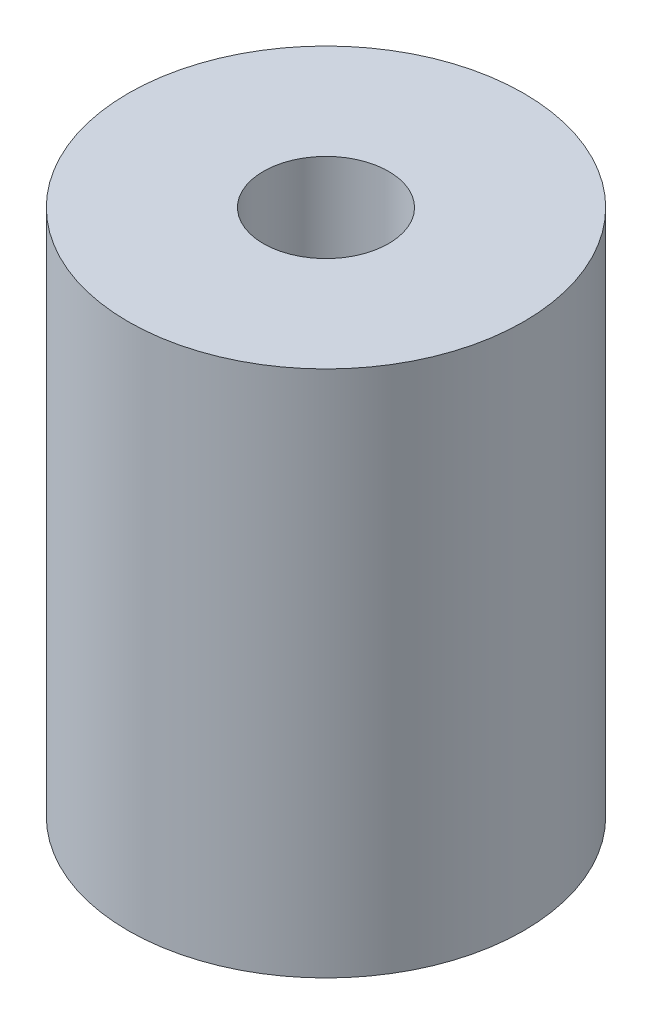
ISO-10303-21;
HEADER;
FILE_DESCRIPTION(('STEP AP214'),'2;1');
FILE_NAME('part.step','',(''),(''),'','','');
FILE_SCHEMA(('AUTOMOTIVE_DESIGN { 1 0 10303 214 1 1 1 1 }'));
ENDSEC;
DATA;
#1=APPLICATION_CONTEXT('core data for automotive mechanical design processes');
#2=APPLICATION_PROTOCOL_DEFINITION('international standard','automotive_design',2000,#1);
#3=PRODUCT_CONTEXT('',#1,'mechanical');
#4=PRODUCT('Part','Part','',(#3));
#5=PRODUCT_RELATED_PRODUCT_CATEGORY('part','',(#4));
#6=PRODUCT_DEFINITION_FORMATION('','',#4);
#7=PRODUCT_DEFINITION_CONTEXT('part definition',#1,'design');
#8=PRODUCT_DEFINITION('design','',#6,#7);
#9=PRODUCT_DEFINITION_SHAPE('','',#8);
#10=(LENGTH_UNIT() NAMED_UNIT(*) SI_UNIT(.MILLI.,.METRE.));
#11=(NAMED_UNIT(*) PLANE_ANGLE_UNIT() SI_UNIT($,.RADIAN.));
#12=(NAMED_UNIT(*) SI_UNIT($,.STERADIAN.) SOLID_ANGLE_UNIT());
#13=UNCERTAINTY_MEASURE_WITH_UNIT(LENGTH_MEASURE(1.E-05),#10,'distance_accuracy_value','');
#14=(GEOMETRIC_REPRESENTATION_CONTEXT(3) GLOBAL_UNCERTAINTY_ASSIGNED_CONTEXT((#13)) GLOBAL_UNIT_ASSIGNED_CONTEXT((#10,
#11,#12)) REPRESENTATION_CONTEXT('',''));
#15=CARTESIAN_POINT('',(0.,0.,0.));
#16=DIRECTION('',(0.,0.,1.));
#17=DIRECTION('',(1.,0.,0.));
#18=AXIS2_PLACEMENT_3D('',#15,#16,#17);
#19=CARTESIAN_POINT('',(0.,10.,0.));
#20=DIRECTION('',(0.,-1.,0.));
#21=DIRECTION('',(0.,0.,-1.));
#22=AXIS2_PLACEMENT_3D('',#19,#20,#21);
#23=CYLINDRICAL_SURFACE('',#22,7.5);
#24=CARTESIAN_POINT('',(0.,10.,0.));
#25=DIRECTION('',(0.,1.,0.));
#26=DIRECTION('',(0.,0.,1.));
#27=AXIS2_PLACEMENT_3D('',#24,#25,#26);
#28=CIRCLE('',#27,7.5);
#29=CARTESIAN_POINT('',(0.,10.,7.5));
#30=VERTEX_POINT('',#29);
#31=EDGE_CURVE('E10',#30,#30,#28,.T.);
#32=ORIENTED_EDGE('',*,*,#31,.F.);
#33=EDGE_LOOP('',(#32));
#34=FACE_BOUND('',#33,.T.);
#35=CARTESIAN_POINT('',(0.,-10.,0.));
#36=DIRECTION('',(0.,1.,0.));
#37=DIRECTION('',(0.,0.,1.));
#38=AXIS2_PLACEMENT_3D('',#35,#36,#37);
#39=CIRCLE('',#38,7.5);
#40=CARTESIAN_POINT('',(0.,-10.,7.5));
#41=VERTEX_POINT('',#40);
#42=EDGE_CURVE('E37',#41,#41,#39,.T.);
#43=ORIENTED_EDGE('',*,*,#42,.T.);
#44=EDGE_LOOP('',(#43));
#45=FACE_BOUND('',#44,.T.);
#46=ADVANCED_FACE('F34',(#34,#45),#23,.T.);
#47=CARTESIAN_POINT('',(0.,10.,0.));
#48=DIRECTION('',(0.,1.,0.));
#49=DIRECTION('',(0.,0.,1.));
#50=AXIS2_PLACEMENT_3D('',#47,#48,#49);
#51=PLANE('',#50);
#52=CARTESIAN_POINT('',(0.,10.,0.));
#53=DIRECTION('',(0.,1.,0.));
#54=DIRECTION('',(0.,0.,1.));
#55=AXIS2_PLACEMENT_3D('',#52,#53,#54);
#56=CIRCLE('',#55,2.375);
#57=CARTESIAN_POINT('',(0.,10.,2.375));
#58=VERTEX_POINT('',#57);
#59=EDGE_CURVE('E46',#58,#58,#56,.T.);
#60=ORIENTED_EDGE('',*,*,#59,.F.);
#61=EDGE_LOOP('',(#60));
#62=FACE_BOUND('',#61,.T.);
#63=ORIENTED_EDGE('',*,*,#31,.T.);
#64=EDGE_LOOP('',(#63));
#65=FACE_BOUND('',#64,.T.);
#66=ADVANCED_FACE('F71',(#62,#65),#51,.T.);
#67=CARTESIAN_POINT('',(0.,-10.,0.));
#68=DIRECTION('',(0.,1.,0.));
#69=DIRECTION('',(0.,0.,1.));
#70=AXIS2_PLACEMENT_3D('',#67,#68,#69);
#71=PLANE('',#70);
#72=CARTESIAN_POINT('',(0.,-10.,0.));
#73=DIRECTION('',(0.,-1.,0.));
#74=DIRECTION('',(0.,0.,-1.));
#75=AXIS2_PLACEMENT_3D('',#72,#73,#74);
#76=CIRCLE('',#75,2.375);
#77=CARTESIAN_POINT('',(0.,-10.,-2.375));
#78=VERTEX_POINT('',#77);
#79=EDGE_CURVE('E52',#78,#78,#76,.T.);
#80=ORIENTED_EDGE('',*,*,#79,.F.);
#81=EDGE_LOOP('',(#80));
#82=FACE_BOUND('',#81,.T.);
#83=ORIENTED_EDGE('',*,*,#42,.F.);
#84=EDGE_LOOP('',(#83));
#85=FACE_BOUND('',#84,.T.);
#86=ADVANCED_FACE('F67',(#82,#85),#71,.F.);
#87=CARTESIAN_POINT('',(0.,1.,0.));
#88=DIRECTION('',(0.,1.,0.));
#89=DIRECTION('',(0.,0.,1.));
#90=AXIS2_PLACEMENT_3D('',#87,#88,#89);
#91=CYLINDRICAL_SURFACE('',#90,2.375);
#92=CARTESIAN_POINT('',(0.,1.,0.));
#93=DIRECTION('',(0.,1.,0.));
#94=DIRECTION('',(0.,0.,1.));
#95=AXIS2_PLACEMENT_3D('',#92,#93,#94);
#96=CIRCLE('',#95,2.375);
#97=CARTESIAN_POINT('',(0.,1.,2.375));
#98=VERTEX_POINT('',#97);
#99=EDGE_CURVE('E44',#98,#98,#96,.T.);
#100=ORIENTED_EDGE('',*,*,#99,.F.);
#101=EDGE_LOOP('',(#100));
#102=FACE_BOUND('',#101,.T.);
#103=ORIENTED_EDGE('',*,*,#59,.T.);
#104=EDGE_LOOP('',(#103));
#105=FACE_BOUND('',#104,.T.);
#106=ADVANCED_FACE('F70',(#102,#105),#91,.F.);
#107=CARTESIAN_POINT('',(0.,1.,0.));
#108=DIRECTION('',(0.,1.,0.));
#109=DIRECTION('',(0.,0.,1.));
#110=AXIS2_PLACEMENT_3D('',#107,#108,#109);
#111=PLANE('',#110);
#112=ORIENTED_EDGE('',*,*,#99,.T.);
#113=EDGE_LOOP('',(#112));
#114=FACE_BOUND('',#113,.T.);
#115=ADVANCED_FACE('F63',(#114),#111,.T.);
#116=CARTESIAN_POINT('',(0.,-1.,0.));
#117=DIRECTION('',(0.,-1.,0.));
#118=DIRECTION('',(0.,0.,-1.));
#119=AXIS2_PLACEMENT_3D('',#116,#117,#118);
#120=CYLINDRICAL_SURFACE('',#119,2.375);
#121=CARTESIAN_POINT('',(0.,-1.,0.));
#122=DIRECTION('',(0.,-1.,0.));
#123=DIRECTION('',(0.,0.,-1.));
#124=AXIS2_PLACEMENT_3D('',#121,#122,#123);
#125=CIRCLE('',#124,2.375);
#126=CARTESIAN_POINT('',(0.,-1.,-2.375));
#127=VERTEX_POINT('',#126);
#128=EDGE_CURVE('E49',#127,#127,#125,.T.);
#129=ORIENTED_EDGE('',*,*,#128,.F.);
#130=EDGE_LOOP('',(#129));
#131=FACE_BOUND('',#130,.T.);
#132=ORIENTED_EDGE('',*,*,#79,.T.);
#133=EDGE_LOOP('',(#132));
#134=FACE_BOUND('',#133,.T.);
#135=ADVANCED_FACE('F60',(#131,#134),#120,.F.);
#136=CARTESIAN_POINT('',(0.,-1.,0.));
#137=DIRECTION('',(0.,-1.,0.));
#138=DIRECTION('',(0.,0.,-1.));
#139=AXIS2_PLACEMENT_3D('',#136,#137,#138);
#140=PLANE('',#139);
#141=ORIENTED_EDGE('',*,*,#128,.T.);
#142=EDGE_LOOP('',(#141));
#143=FACE_BOUND('',#142,.T.);
#144=ADVANCED_FACE('F58',(#143),#140,.T.);
#145=CLOSED_SHELL('',(#46,#66,#86,#106,#115,#135,#144));
#146=MANIFOLD_SOLID_BREP('B2',#145);
#147=ADVANCED_BREP_SHAPE_REPRESENTATION('',(#18,#146),#14);
#148=SHAPE_DEFINITION_REPRESENTATION(#9,#147);
ENDSEC;
END-ISO-10303-21;
